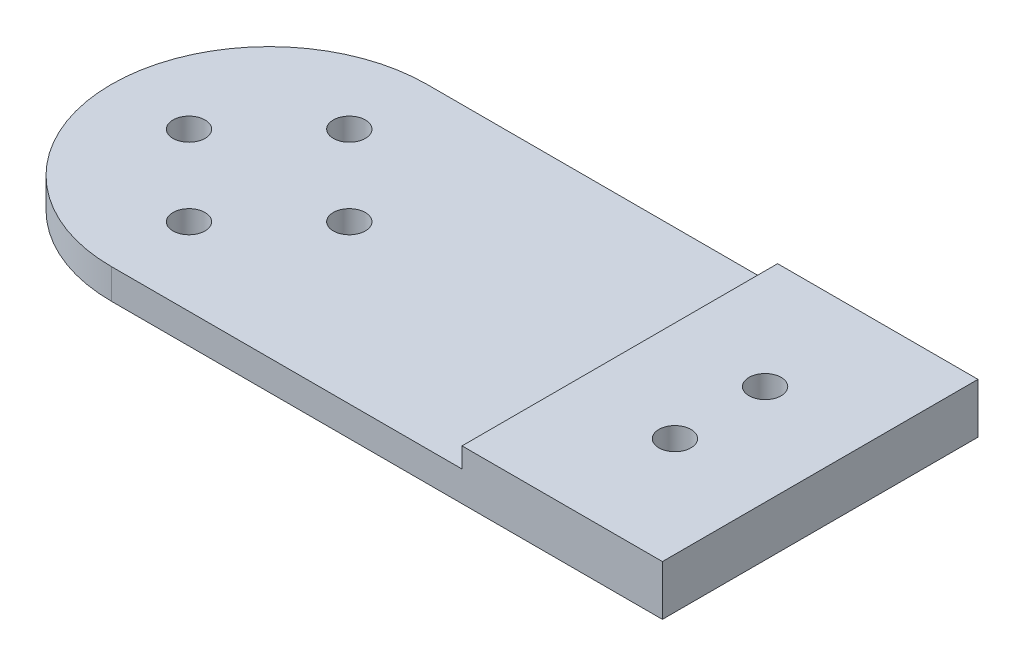
ISO-10303-21;
HEADER;
FILE_DESCRIPTION(('STEP AP214'),'2;1');
FILE_NAME('part.step','',(''),(''),'','','');
FILE_SCHEMA(('AUTOMOTIVE_DESIGN { 1 0 10303 214 1 1 1 1 }'));
ENDSEC;
DATA;
#1=APPLICATION_CONTEXT('core data for automotive mechanical design processes');
#2=APPLICATION_PROTOCOL_DEFINITION('international standard','automotive_design',2000,#1);
#3=PRODUCT_CONTEXT('',#1,'mechanical');
#4=PRODUCT('Part','Part','',(#3));
#5=PRODUCT_RELATED_PRODUCT_CATEGORY('part','',(#4));
#6=PRODUCT_DEFINITION_FORMATION('','',#4);
#7=PRODUCT_DEFINITION_CONTEXT('part definition',#1,'design');
#8=PRODUCT_DEFINITION('design','',#6,#7);
#9=PRODUCT_DEFINITION_SHAPE('','',#8);
#10=(LENGTH_UNIT() NAMED_UNIT(*) SI_UNIT(.MILLI.,.METRE.));
#11=(NAMED_UNIT(*) PLANE_ANGLE_UNIT() SI_UNIT($,.RADIAN.));
#12=(NAMED_UNIT(*) SI_UNIT($,.STERADIAN.) SOLID_ANGLE_UNIT());
#13=UNCERTAINTY_MEASURE_WITH_UNIT(LENGTH_MEASURE(1.E-05),#10,'distance_accuracy_value','');
#14=(GEOMETRIC_REPRESENTATION_CONTEXT(3) GLOBAL_UNCERTAINTY_ASSIGNED_CONTEXT((#13)) GLOBAL_UNIT_ASSIGNED_CONTEXT((#10,
#11,#12)) REPRESENTATION_CONTEXT('',''));
#15=CARTESIAN_POINT('',(0.,0.,0.));
#16=DIRECTION('',(0.,0.,1.));
#17=DIRECTION('',(1.,0.,0.));
#18=AXIS2_PLACEMENT_3D('',#15,#16,#17);
#19=CARTESIAN_POINT('',(0.,3.,0.));
#20=DIRECTION('',(0.,-1.,0.));
#21=DIRECTION('',(0.,0.,-1.));
#22=AXIS2_PLACEMENT_3D('',#19,#20,#21);
#23=CYLINDRICAL_SURFACE('',#22,15.75);
#24=DIRECTION('',(0.,-1.,0.));
#25=VECTOR('',#24,1.);
#26=CARTESIAN_POINT('',(0.,3.,15.75));
#27=LINE('',#26,#25);
#28=CARTESIAN_POINT('',(0.,3.,15.75));
#29=VERTEX_POINT('',#28);
#30=CARTESIAN_POINT('',(0.,0.,15.75));
#31=VERTEX_POINT('',#30);
#32=EDGE_CURVE('E93',#29,#31,#27,.T.);
#33=ORIENTED_EDGE('',*,*,#32,.F.);
#34=CARTESIAN_POINT('',(0.,3.,0.));
#35=DIRECTION('',(0.,1.,0.));
#36=DIRECTION('',(0.,0.,1.));
#37=AXIS2_PLACEMENT_3D('',#34,#35,#36);
#38=CIRCLE('',#37,15.75);
#39=CARTESIAN_POINT('',(0.,3.,-15.75));
#40=VERTEX_POINT('',#39);
#41=EDGE_CURVE('E11',#40,#29,#38,.T.);
#42=ORIENTED_EDGE('',*,*,#41,.F.);
#43=DIRECTION('',(0.,-1.,0.));
#44=VECTOR('',#43,1.);
#45=CARTESIAN_POINT('',(0.,3.,-15.75));
#46=LINE('',#45,#44);
#47=CARTESIAN_POINT('',(0.,0.,-15.75));
#48=VERTEX_POINT('',#47);
#49=EDGE_CURVE('E129',#40,#48,#46,.T.);
#50=ORIENTED_EDGE('',*,*,#49,.T.);
#51=CARTESIAN_POINT('',(0.,0.,0.));
#52=DIRECTION('',(0.,1.,0.));
#53=DIRECTION('',(0.,0.,1.));
#54=AXIS2_PLACEMENT_3D('',#51,#52,#53);
#55=CIRCLE('',#54,15.75);
#56=EDGE_CURVE('E38',#48,#31,#55,.T.);
#57=ORIENTED_EDGE('',*,*,#56,.T.);
#58=EDGE_LOOP('',(#33,#42,#50,#57));
#59=FACE_BOUND('',#58,.T.);
#60=ADVANCED_FACE('F35',(#59),#23,.T.);
#61=CARTESIAN_POINT('',(0.,3.,0.));
#62=DIRECTION('',(0.,1.,0.));
#63=DIRECTION('',(0.,0.,1.));
#64=AXIS2_PLACEMENT_3D('',#61,#62,#63);
#65=PLANE('',#64);
#66=DIRECTION('',(0.,0.,1.));
#67=VECTOR('',#66,1.);
#68=CARTESIAN_POINT('',(35.,3.,0.));
#69=LINE('',#68,#67);
#70=CARTESIAN_POINT('',(35.,3.,-15.75));
#71=VERTEX_POINT('',#70);
#72=CARTESIAN_POINT('',(35.,3.,15.75));
#73=VERTEX_POINT('',#72);
#74=EDGE_CURVE('E120',#71,#73,#69,.T.);
#75=ORIENTED_EDGE('',*,*,#74,.F.);
#76=DIRECTION('',(1.,0.,0.));
#77=VECTOR('',#76,1.);
#78=CARTESIAN_POINT('',(0.,3.,-15.75));
#79=LINE('',#78,#77);
#80=EDGE_CURVE('E124',#40,#71,#79,.T.);
#81=ORIENTED_EDGE('',*,*,#80,.F.);
#82=ORIENTED_EDGE('',*,*,#41,.T.);
#83=DIRECTION('',(-1.,0.,0.));
#84=VECTOR('',#83,1.);
#85=CARTESIAN_POINT('',(0.,3.,15.75));
#86=LINE('',#85,#84);
#87=EDGE_CURVE('E127',#73,#29,#86,.T.);
#88=ORIENTED_EDGE('',*,*,#87,.F.);
#89=EDGE_LOOP('',(#75,#81,#82,#88));
#90=FACE_BOUND('',#89,.T.);
#91=CARTESIAN_POINT('',(0.,3.,8.));
#92=DIRECTION('',(0.,1.,0.));
#93=DIRECTION('',(0.,0.,-1.));
#94=AXIS2_PLACEMENT_3D('',#91,#92,#93);
#95=CIRCLE('',#94,1.6);
#96=CARTESIAN_POINT('',(0.,3.,6.4));
#97=VERTEX_POINT('',#96);
#98=EDGE_CURVE('E145',#97,#97,#95,.T.);
#99=ORIENTED_EDGE('',*,*,#98,.F.);
#100=EDGE_LOOP('',(#99));
#101=FACE_BOUND('',#100,.T.);
#102=CARTESIAN_POINT('',(0.,3.,-8.));
#103=DIRECTION('',(0.,1.,0.));
#104=DIRECTION('',(0.,0.,1.));
#105=AXIS2_PLACEMENT_3D('',#102,#103,#104);
#106=CIRCLE('',#105,1.6);
#107=CARTESIAN_POINT('',(0.,3.,-6.4));
#108=VERTEX_POINT('',#107);
#109=EDGE_CURVE('E157',#108,#108,#106,.T.);
#110=ORIENTED_EDGE('',*,*,#109,.F.);
#111=EDGE_LOOP('',(#110));
#112=FACE_BOUND('',#111,.T.);
#113=CARTESIAN_POINT('',(8.,3.,0.));
#114=DIRECTION('',(0.,1.,0.));
#115=DIRECTION('',(0.,0.,1.));
#116=AXIS2_PLACEMENT_3D('',#113,#114,#115);
#117=CIRCLE('',#116,1.6);
#118=CARTESIAN_POINT('',(8.,3.,1.6));
#119=VERTEX_POINT('',#118);
#120=EDGE_CURVE('E151',#119,#119,#117,.T.);
#121=ORIENTED_EDGE('',*,*,#120,.F.);
#122=EDGE_LOOP('',(#121));
#123=FACE_BOUND('',#122,.T.);
#124=CARTESIAN_POINT('',(-8.,3.,0.));
#125=DIRECTION('',(0.,1.,0.));
#126=DIRECTION('',(0.,0.,-1.));
#127=AXIS2_PLACEMENT_3D('',#124,#125,#126);
#128=CIRCLE('',#127,1.6);
#129=CARTESIAN_POINT('',(-8.,3.,-1.6));
#130=VERTEX_POINT('',#129);
#131=EDGE_CURVE('E139',#130,#130,#128,.T.);
#132=ORIENTED_EDGE('',*,*,#131,.F.);
#133=EDGE_LOOP('',(#132));
#134=FACE_BOUND('',#133,.T.);
#135=ADVANCED_FACE('F178',(#90,#101,#112,#123,#134),#65,.T.);
#136=CARTESIAN_POINT('',(0.,0.,0.));
#137=DIRECTION('',(0.,1.,0.));
#138=DIRECTION('',(0.,0.,1.));
#139=AXIS2_PLACEMENT_3D('',#136,#137,#138);
#140=PLANE('',#139);
#141=CARTESIAN_POINT('',(45.0000000000005,0.,-4.5000000000004));
#142=DIRECTION('',(0.,1.,0.));
#143=DIRECTION('',(0.,0.,1.));
#144=AXIS2_PLACEMENT_3D('',#141,#142,#143);
#145=CIRCLE('',#144,1.6);
#146=CARTESIAN_POINT('',(45.0000000000005,0.,-2.9000000000004));
#147=VERTEX_POINT('',#146);
#148=EDGE_CURVE('E108',#147,#147,#145,.T.);
#149=ORIENTED_EDGE('',*,*,#148,.T.);
#150=EDGE_LOOP('',(#149));
#151=FACE_BOUND('',#150,.T.);
#152=CARTESIAN_POINT('',(45.0000000000005,0.,4.5000000000004));
#153=DIRECTION('',(0.,1.,0.));
#154=DIRECTION('',(0.,0.,1.));
#155=AXIS2_PLACEMENT_3D('',#152,#153,#154);
#156=CIRCLE('',#155,1.6);
#157=CARTESIAN_POINT('',(45.0000000000005,0.,6.10000000000039));
#158=VERTEX_POINT('',#157);
#159=EDGE_CURVE('E111',#158,#158,#156,.T.);
#160=ORIENTED_EDGE('',*,*,#159,.T.);
#161=EDGE_LOOP('',(#160));
#162=FACE_BOUND('',#161,.T.);
#163=DIRECTION('',(1.,0.,0.));
#164=VECTOR('',#163,1.);
#165=CARTESIAN_POINT('',(0.,0.,-15.75));
#166=LINE('',#165,#164);
#167=CARTESIAN_POINT('',(55.,0.,-15.75));
#168=VERTEX_POINT('',#167);
#169=EDGE_CURVE('E123',#48,#168,#166,.T.);
#170=ORIENTED_EDGE('',*,*,#169,.T.);
#171=DIRECTION('',(0.,0.,1.));
#172=VECTOR('',#171,1.);
#173=CARTESIAN_POINT('',(55.,0.,15.75));
#174=LINE('',#173,#172);
#175=CARTESIAN_POINT('',(55.,0.,15.75));
#176=VERTEX_POINT('',#175);
#177=EDGE_CURVE('E131',#168,#176,#174,.T.);
#178=ORIENTED_EDGE('',*,*,#177,.T.);
#179=DIRECTION('',(-1.,0.,0.));
#180=VECTOR('',#179,1.);
#181=CARTESIAN_POINT('',(0.,0.,15.75));
#182=LINE('',#181,#180);
#183=EDGE_CURVE('E57',#176,#31,#182,.T.);
#184=ORIENTED_EDGE('',*,*,#183,.T.);
#185=ORIENTED_EDGE('',*,*,#56,.F.);
#186=EDGE_LOOP('',(#170,#178,#184,#185));
#187=FACE_BOUND('',#186,.T.);
#188=CARTESIAN_POINT('',(0.,0.,-8.));
#189=DIRECTION('',(0.,1.,0.));
#190=DIRECTION('',(0.,0.,1.));
#191=AXIS2_PLACEMENT_3D('',#188,#189,#190);
#192=CIRCLE('',#191,1.6);
#193=CARTESIAN_POINT('',(0.,0.,-6.4));
#194=VERTEX_POINT('',#193);
#195=EDGE_CURVE('E154',#194,#194,#192,.T.);
#196=ORIENTED_EDGE('',*,*,#195,.T.);
#197=EDGE_LOOP('',(#196));
#198=FACE_BOUND('',#197,.T.);
#199=CARTESIAN_POINT('',(8.,0.,0.));
#200=DIRECTION('',(0.,1.,0.));
#201=DIRECTION('',(0.,0.,1.));
#202=AXIS2_PLACEMENT_3D('',#199,#200,#201);
#203=CIRCLE('',#202,1.6);
#204=CARTESIAN_POINT('',(8.,0.,1.6));
#205=VERTEX_POINT('',#204);
#206=EDGE_CURVE('E148',#205,#205,#203,.T.);
#207=ORIENTED_EDGE('',*,*,#206,.T.);
#208=EDGE_LOOP('',(#207));
#209=FACE_BOUND('',#208,.T.);
#210=CARTESIAN_POINT('',(0.,0.,8.));
#211=DIRECTION('',(0.,1.,0.));
#212=DIRECTION('',(0.,0.,-1.));
#213=AXIS2_PLACEMENT_3D('',#210,#211,#212);
#214=CIRCLE('',#213,1.6);
#215=CARTESIAN_POINT('',(0.,0.,6.4));
#216=VERTEX_POINT('',#215);
#217=EDGE_CURVE('E142',#216,#216,#214,.T.);
#218=ORIENTED_EDGE('',*,*,#217,.T.);
#219=EDGE_LOOP('',(#218));
#220=FACE_BOUND('',#219,.T.);
#221=CARTESIAN_POINT('',(-8.,0.,0.));
#222=DIRECTION('',(0.,1.,0.));
#223=DIRECTION('',(0.,0.,-1.));
#224=AXIS2_PLACEMENT_3D('',#221,#222,#223);
#225=CIRCLE('',#224,1.6);
#226=CARTESIAN_POINT('',(-8.,0.,-1.6));
#227=VERTEX_POINT('',#226);
#228=EDGE_CURVE('E134',#227,#227,#225,.T.);
#229=ORIENTED_EDGE('',*,*,#228,.T.);
#230=EDGE_LOOP('',(#229));
#231=FACE_BOUND('',#230,.T.);
#232=ADVANCED_FACE('F163',(#151,#162,#187,#198,#209,#220,#231),#140,.F.);
#233=CARTESIAN_POINT('',(0.,3.,-8.));
#234=DIRECTION('',(0.,-1.,0.));
#235=DIRECTION('',(0.,0.,-1.));
#236=AXIS2_PLACEMENT_3D('',#233,#234,#235);
#237=CYLINDRICAL_SURFACE('',#236,1.6);
#238=ORIENTED_EDGE('',*,*,#109,.T.);
#239=EDGE_LOOP('',(#238));
#240=FACE_BOUND('',#239,.T.);
#241=ORIENTED_EDGE('',*,*,#195,.F.);
#242=EDGE_LOOP('',(#241));
#243=FACE_BOUND('',#242,.T.);
#244=ADVANCED_FACE('F166',(#240,#243),#237,.F.);
#245=CARTESIAN_POINT('',(8.,3.,0.));
#246=DIRECTION('',(0.,-1.,0.));
#247=DIRECTION('',(0.,0.,-1.));
#248=AXIS2_PLACEMENT_3D('',#245,#246,#247);
#249=CYLINDRICAL_SURFACE('',#248,1.6);
#250=ORIENTED_EDGE('',*,*,#120,.T.);
#251=EDGE_LOOP('',(#250));
#252=FACE_BOUND('',#251,.T.);
#253=ORIENTED_EDGE('',*,*,#206,.F.);
#254=EDGE_LOOP('',(#253));
#255=FACE_BOUND('',#254,.T.);
#256=ADVANCED_FACE('F168',(#252,#255),#249,.F.);
#257=CARTESIAN_POINT('',(0.,3.,8.));
#258=DIRECTION('',(0.,-1.,0.));
#259=DIRECTION('',(0.,0.,-1.));
#260=AXIS2_PLACEMENT_3D('',#257,#258,#259);
#261=CYLINDRICAL_SURFACE('',#260,1.6);
#262=ORIENTED_EDGE('',*,*,#98,.T.);
#263=EDGE_LOOP('',(#262));
#264=FACE_BOUND('',#263,.T.);
#265=ORIENTED_EDGE('',*,*,#217,.F.);
#266=EDGE_LOOP('',(#265));
#267=FACE_BOUND('',#266,.T.);
#268=ADVANCED_FACE('F175',(#264,#267),#261,.F.);
#269=CARTESIAN_POINT('',(-8.,3.,0.));
#270=DIRECTION('',(0.,-1.,0.));
#271=DIRECTION('',(0.,0.,-1.));
#272=AXIS2_PLACEMENT_3D('',#269,#270,#271);
#273=CYLINDRICAL_SURFACE('',#272,1.6);
#274=ORIENTED_EDGE('',*,*,#131,.T.);
#275=EDGE_LOOP('',(#274));
#276=FACE_BOUND('',#275,.T.);
#277=ORIENTED_EDGE('',*,*,#228,.F.);
#278=EDGE_LOOP('',(#277));
#279=FACE_BOUND('',#278,.T.);
#280=ADVANCED_FACE('F212',(#276,#279),#273,.F.);
#281=CARTESIAN_POINT('',(0.,3.,15.75));
#282=DIRECTION('',(0.,0.,1.));
#283=DIRECTION('',(1.,0.,0.));
#284=AXIS2_PLACEMENT_3D('',#281,#282,#283);
#285=PLANE('',#284);
#286=ORIENTED_EDGE('',*,*,#32,.T.);
#287=ORIENTED_EDGE('',*,*,#183,.F.);
#288=DIRECTION('',(0.,-1.,0.));
#289=VECTOR('',#288,1.);
#290=CARTESIAN_POINT('',(55.,3.,15.75));
#291=LINE('',#290,#289);
#292=CARTESIAN_POINT('',(55.,5.,15.75));
#293=VERTEX_POINT('',#292);
#294=EDGE_CURVE('E85',#293,#176,#291,.T.);
#295=ORIENTED_EDGE('',*,*,#294,.F.);
#296=DIRECTION('',(-1.,0.,0.));
#297=VECTOR('',#296,1.);
#298=CARTESIAN_POINT('',(55.,5.,15.75));
#299=LINE('',#298,#297);
#300=CARTESIAN_POINT('',(35.,5.,15.75));
#301=VERTEX_POINT('',#300);
#302=EDGE_CURVE('E89',#293,#301,#299,.T.);
#303=ORIENTED_EDGE('',*,*,#302,.T.);
#304=DIRECTION('',(0.,-1.,0.));
#305=VECTOR('',#304,1.);
#306=CARTESIAN_POINT('',(35.,5.,15.75));
#307=LINE('',#306,#305);
#308=EDGE_CURVE('E49',#301,#73,#307,.T.);
#309=ORIENTED_EDGE('',*,*,#308,.T.);
#310=ORIENTED_EDGE('',*,*,#87,.T.);
#311=EDGE_LOOP('',(#286,#287,#295,#303,#309,#310));
#312=FACE_BOUND('',#311,.T.);
#313=ADVANCED_FACE('F88',(#312),#285,.T.);
#314=CARTESIAN_POINT('',(55.,3.,15.75));
#315=DIRECTION('',(1.,0.,0.));
#316=DIRECTION('',(0.,0.,-1.));
#317=AXIS2_PLACEMENT_3D('',#314,#315,#316);
#318=PLANE('',#317);
#319=ORIENTED_EDGE('',*,*,#177,.F.);
#320=DIRECTION('',(0.,-1.,0.));
#321=VECTOR('',#320,1.);
#322=CARTESIAN_POINT('',(55.,3.,-15.75));
#323=LINE('',#322,#321);
#324=CARTESIAN_POINT('',(55.,5.,-15.75));
#325=VERTEX_POINT('',#324);
#326=EDGE_CURVE('E94',#325,#168,#323,.T.);
#327=ORIENTED_EDGE('',*,*,#326,.F.);
#328=DIRECTION('',(0.,0.,1.));
#329=VECTOR('',#328,1.);
#330=CARTESIAN_POINT('',(55.,5.,15.75));
#331=LINE('',#330,#329);
#332=EDGE_CURVE('E101',#325,#293,#331,.T.);
#333=ORIENTED_EDGE('',*,*,#332,.T.);
#334=ORIENTED_EDGE('',*,*,#294,.T.);
#335=EDGE_LOOP('',(#319,#327,#333,#334));
#336=FACE_BOUND('',#335,.T.);
#337=ADVANCED_FACE('F106',(#336),#318,.T.);
#338=CARTESIAN_POINT('',(0.,3.,-15.75));
#339=DIRECTION('',(0.,0.,-1.));
#340=DIRECTION('',(-1.,0.,0.));
#341=AXIS2_PLACEMENT_3D('',#338,#339,#340);
#342=PLANE('',#341);
#343=ORIENTED_EDGE('',*,*,#80,.T.);
#344=DIRECTION('',(0.,-1.,0.));
#345=VECTOR('',#344,1.);
#346=CARTESIAN_POINT('',(35.,5.,-15.75));
#347=LINE('',#346,#345);
#348=CARTESIAN_POINT('',(35.,5.,-15.75));
#349=VERTEX_POINT('',#348);
#350=EDGE_CURVE('E118',#349,#71,#347,.T.);
#351=ORIENTED_EDGE('',*,*,#350,.F.);
#352=DIRECTION('',(1.,0.,0.));
#353=VECTOR('',#352,1.);
#354=CARTESIAN_POINT('',(55.,5.,-15.75));
#355=LINE('',#354,#353);
#356=EDGE_CURVE('E116',#349,#325,#355,.T.);
#357=ORIENTED_EDGE('',*,*,#356,.T.);
#358=ORIENTED_EDGE('',*,*,#326,.T.);
#359=ORIENTED_EDGE('',*,*,#169,.F.);
#360=ORIENTED_EDGE('',*,*,#49,.F.);
#361=EDGE_LOOP('',(#343,#351,#357,#358,#359,#360));
#362=FACE_BOUND('',#361,.T.);
#363=ADVANCED_FACE('F194',(#362),#342,.T.);
#364=CARTESIAN_POINT('',(35.,5.,15.75));
#365=DIRECTION('',(-1.,0.,0.));
#366=DIRECTION('',(0.,0.,1.));
#367=AXIS2_PLACEMENT_3D('',#364,#365,#366);
#368=PLANE('',#367);
#369=ORIENTED_EDGE('',*,*,#350,.T.);
#370=ORIENTED_EDGE('',*,*,#74,.T.);
#371=ORIENTED_EDGE('',*,*,#308,.F.);
#372=DIRECTION('',(0.,0.,-1.));
#373=VECTOR('',#372,1.);
#374=CARTESIAN_POINT('',(35.,5.,15.75));
#375=LINE('',#374,#373);
#376=EDGE_CURVE('E104',#301,#349,#375,.T.);
#377=ORIENTED_EDGE('',*,*,#376,.T.);
#378=EDGE_LOOP('',(#369,#370,#371,#377));
#379=FACE_BOUND('',#378,.T.);
#380=ADVANCED_FACE('F197',(#379),#368,.T.);
#381=CARTESIAN_POINT('',(0.,5.,0.));
#382=DIRECTION('',(0.,1.,0.));
#383=DIRECTION('',(0.,0.,1.));
#384=AXIS2_PLACEMENT_3D('',#381,#382,#383);
#385=PLANE('',#384);
#386=CARTESIAN_POINT('',(45.0000000000005,5.,-4.5000000000004));
#387=DIRECTION('',(0.,1.,0.));
#388=DIRECTION('',(0.,0.,1.));
#389=AXIS2_PLACEMENT_3D('',#386,#387,#388);
#390=CIRCLE('',#389,1.6);
#391=CARTESIAN_POINT('',(45.0000000000005,5.,-2.9000000000004));
#392=VERTEX_POINT('',#391);
#393=EDGE_CURVE('E301',#392,#392,#390,.T.);
#394=ORIENTED_EDGE('',*,*,#393,.F.);
#395=EDGE_LOOP('',(#394));
#396=FACE_BOUND('',#395,.T.);
#397=CARTESIAN_POINT('',(45.0000000000005,5.,4.5000000000004));
#398=DIRECTION('',(0.,1.,0.));
#399=DIRECTION('',(0.,0.,1.));
#400=AXIS2_PLACEMENT_3D('',#397,#398,#399);
#401=CIRCLE('',#400,1.6);
#402=CARTESIAN_POINT('',(45.0000000000005,5.,6.10000000000039));
#403=VERTEX_POINT('',#402);
#404=EDGE_CURVE('E307',#403,#403,#401,.T.);
#405=ORIENTED_EDGE('',*,*,#404,.F.);
#406=EDGE_LOOP('',(#405));
#407=FACE_BOUND('',#406,.T.);
#408=ORIENTED_EDGE('',*,*,#332,.F.);
#409=ORIENTED_EDGE('',*,*,#356,.F.);
#410=ORIENTED_EDGE('',*,*,#376,.F.);
#411=ORIENTED_EDGE('',*,*,#302,.F.);
#412=EDGE_LOOP('',(#408,#409,#410,#411));
#413=FACE_BOUND('',#412,.T.);
#414=ADVANCED_FACE('F99',(#396,#407,#413),#385,.T.);
#415=CARTESIAN_POINT('',(45.0000000000005,-5.,4.5000000000004));
#416=DIRECTION('',(0.,1.,0.));
#417=DIRECTION('',(0.,0.,1.));
#418=AXIS2_PLACEMENT_3D('',#415,#416,#417);
#419=CYLINDRICAL_SURFACE('',#418,1.6);
#420=ORIENTED_EDGE('',*,*,#404,.T.);
#421=EDGE_LOOP('',(#420));
#422=FACE_BOUND('',#421,.T.);
#423=ORIENTED_EDGE('',*,*,#159,.F.);
#424=EDGE_LOOP('',(#423));
#425=FACE_BOUND('',#424,.T.);
#426=ADVANCED_FACE('F204',(#422,#425),#419,.F.);
#427=CARTESIAN_POINT('',(45.0000000000005,-5.,-4.5000000000004));
#428=DIRECTION('',(0.,1.,0.));
#429=DIRECTION('',(0.,0.,1.));
#430=AXIS2_PLACEMENT_3D('',#427,#428,#429);
#431=CYLINDRICAL_SURFACE('',#430,1.6);
#432=ORIENTED_EDGE('',*,*,#393,.T.);
#433=EDGE_LOOP('',(#432));
#434=FACE_BOUND('',#433,.T.);
#435=ORIENTED_EDGE('',*,*,#148,.F.);
#436=EDGE_LOOP('',(#435));
#437=FACE_BOUND('',#436,.T.);
#438=ADVANCED_FACE('F285',(#434,#437),#431,.F.);
#439=CLOSED_SHELL('',(#60,#135,#232,#244,#256,#268,#280,#313,#337,#363,#380,#414,#426,#438));
#440=MANIFOLD_SOLID_BREP('B2',#439);
#441=ADVANCED_BREP_SHAPE_REPRESENTATION('',(#18,#440),#14);
#442=SHAPE_DEFINITION_REPRESENTATION(#9,#441);
ENDSEC;
END-ISO-10303-21;
